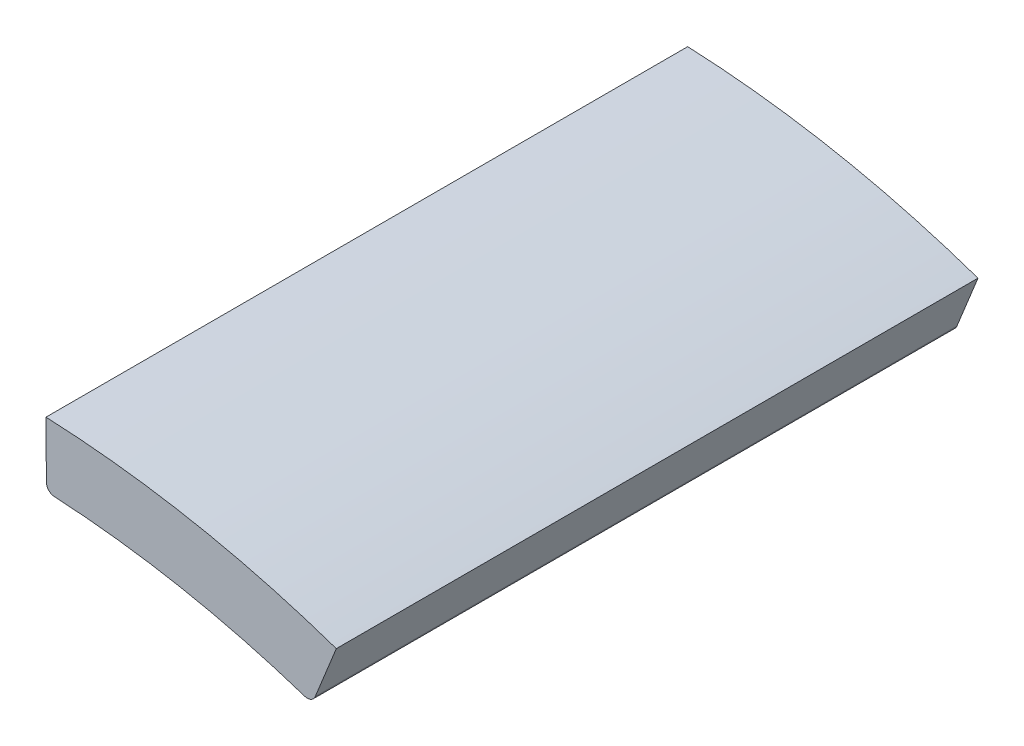
ISO-10303-21;
HEADER;
FILE_DESCRIPTION(('STEP AP214'),'2;1');
FILE_NAME('part.step','',(''),(''),'','','');
FILE_SCHEMA(('AUTOMOTIVE_DESIGN { 1 0 10303 214 1 1 1 1 }'));
ENDSEC;
DATA;
#1=APPLICATION_CONTEXT('core data for automotive mechanical design processes');
#2=APPLICATION_PROTOCOL_DEFINITION('international standard','automotive_design',2000,#1);
#3=PRODUCT_CONTEXT('',#1,'mechanical');
#4=PRODUCT('Part','Part','',(#3));
#5=PRODUCT_RELATED_PRODUCT_CATEGORY('part','',(#4));
#6=PRODUCT_DEFINITION_FORMATION('','',#4);
#7=PRODUCT_DEFINITION_CONTEXT('part definition',#1,'design');
#8=PRODUCT_DEFINITION('design','',#6,#7);
#9=PRODUCT_DEFINITION_SHAPE('','',#8);
#10=(LENGTH_UNIT() NAMED_UNIT(*) SI_UNIT(.MILLI.,.METRE.));
#11=(NAMED_UNIT(*) PLANE_ANGLE_UNIT() SI_UNIT($,.RADIAN.));
#12=(NAMED_UNIT(*) SI_UNIT($,.STERADIAN.) SOLID_ANGLE_UNIT());
#13=UNCERTAINTY_MEASURE_WITH_UNIT(LENGTH_MEASURE(1.E-05),#10,'distance_accuracy_value','');
#14=(GEOMETRIC_REPRESENTATION_CONTEXT(3) GLOBAL_UNCERTAINTY_ASSIGNED_CONTEXT((#13)) GLOBAL_UNIT_ASSIGNED_CONTEXT((#10,
#11,#12)) REPRESENTATION_CONTEXT('',''));
#15=CARTESIAN_POINT('',(0.,0.,0.));
#16=DIRECTION('',(0.,0.,1.));
#17=DIRECTION('',(1.,0.,0.));
#18=AXIS2_PLACEMENT_3D('',#15,#16,#17);
#19=CARTESIAN_POINT('',(-99.4326237515804,21.5657325952445,-15.));
#20=DIRECTION('',(0.,0.,1.));
#21=DIRECTION('',(1.,0.,0.));
#22=AXIS2_PLACEMENT_3D('',#19,#20,#21);
#23=CYLINDRICAL_SURFACE('',#22,0.200000000000001);
#24=CARTESIAN_POINT('',(-99.4326237515804,21.5657325952445,0.));
#25=DIRECTION('',(0.,0.,1.));
#26=DIRECTION('',(1.,0.,0.));
#27=AXIS2_PLACEMENT_3D('',#24,#25,#26);
#28=CIRCLE('',#27,0.200000000000001);
#29=CARTESIAN_POINT('',(-99.4956867111051,21.3759351686655,0.));
#30=VERTEX_POINT('',#29);
#31=CARTESIAN_POINT('',(-99.2472368950267,21.4906878524762,0.));
#32=VERTEX_POINT('',#31);
#33=EDGE_CURVE('E135',#30,#32,#28,.T.);
#34=ORIENTED_EDGE('',*,*,#33,.F.);
#35=DIRECTION('',(0.,0.,1.));
#36=VECTOR('',#35,1.);
#37=CARTESIAN_POINT('',(-99.4956867111051,21.3759351686655,-15.));
#38=LINE('',#37,#36);
#39=CARTESIAN_POINT('',(-99.4956867111051,21.3759351686655,-15.));
#40=VERTEX_POINT('',#39);
#41=EDGE_CURVE('E43',#40,#30,#38,.T.);
#42=ORIENTED_EDGE('',*,*,#41,.F.);
#43=CARTESIAN_POINT('',(-99.4326237515804,21.5657325952445,-15.));
#44=DIRECTION('',(0.,0.,1.));
#45=DIRECTION('',(1.,0.,0.));
#46=AXIS2_PLACEMENT_3D('',#43,#44,#45);
#47=CIRCLE('',#46,0.200000000000001);
#48=CARTESIAN_POINT('',(-99.2472368950267,21.4906878524762,-15.));
#49=VERTEX_POINT('',#48);
#50=EDGE_CURVE('E111',#40,#49,#47,.T.);
#51=ORIENTED_EDGE('',*,*,#50,.T.);
#52=DIRECTION('',(0.,0.,1.));
#53=VECTOR('',#52,1.);
#54=CARTESIAN_POINT('',(-99.2472368950267,21.4906878524762,-15.));
#55=LINE('',#54,#53);
#56=EDGE_CURVE('E11',#49,#32,#55,.T.);
#57=ORIENTED_EDGE('',*,*,#56,.T.);
#58=EDGE_LOOP('',(#34,#42,#51,#57));
#59=FACE_BOUND('',#58,.T.);
#60=ADVANCED_FACE('F33',(#59),#23,.T.);
#61=CARTESIAN_POINT('',(-106.598152526945,3.99624301647085E-12,-15.));
#62=DIRECTION('',(0.,0.,1.));
#63=DIRECTION('',(1.,0.,0.));
#64=AXIS2_PLACEMENT_3D('',#61,#62,#63);
#65=CYLINDRICAL_SURFACE('',#64,22.525);
#66=CARTESIAN_POINT('',(-106.598152526945,3.99624301647085E-12,0.));
#67=DIRECTION('',(0.,0.,-1.));
#68=DIRECTION('',(1.,0.,0.));
#69=AXIS2_PLACEMENT_3D('',#66,#67,#68);
#70=CIRCLE('',#69,22.525);
#71=CARTESIAN_POINT('',(-105.34216191213,22.489955815334,0.));
#72=VERTEX_POINT('',#71);
#73=EDGE_CURVE('E98',#72,#30,#70,.T.);
#74=ORIENTED_EDGE('',*,*,#73,.F.);
#75=DIRECTION('',(0.,0.,1.));
#76=VECTOR('',#75,1.);
#77=CARTESIAN_POINT('',(-105.34216191213,22.489955815334,-15.));
#78=LINE('',#77,#76);
#79=CARTESIAN_POINT('',(-105.34216191213,22.489955815334,-15.));
#80=VERTEX_POINT('',#79);
#81=EDGE_CURVE('E93',#80,#72,#78,.T.);
#82=ORIENTED_EDGE('',*,*,#81,.F.);
#83=CARTESIAN_POINT('',(-106.598152526945,3.99624301647085E-12,-15.));
#84=DIRECTION('',(0.,0.,-1.));
#85=DIRECTION('',(1.,0.,0.));
#86=AXIS2_PLACEMENT_3D('',#83,#84,#85);
#87=CIRCLE('',#86,22.525);
#88=EDGE_CURVE('E96',#80,#40,#87,.T.);
#89=ORIENTED_EDGE('',*,*,#88,.T.);
#90=ORIENTED_EDGE('',*,*,#41,.T.);
#91=EDGE_LOOP('',(#74,#82,#89,#90));
#92=FACE_BOUND('',#91,.T.);
#93=ADVANCED_FACE('F95',(#92),#65,.F.);
#94=CARTESIAN_POINT('',(-105.331009942184,22.6896446572013,-15.));
#95=DIRECTION('',(0.,0.,1.));
#96=DIRECTION('',(1.,0.,0.));
#97=AXIS2_PLACEMENT_3D('',#94,#95,#96);
#98=CYLINDRICAL_SURFACE('',#97,0.200000000000001);
#99=CARTESIAN_POINT('',(-105.331009942184,22.6896446572013,0.));
#100=DIRECTION('',(0.,0.,1.));
#101=DIRECTION('',(1.,0.,0.));
#102=AXIS2_PLACEMENT_3D('',#99,#100,#101);
#103=CIRCLE('',#102,0.200000000000001);
#104=CARTESIAN_POINT('',(-105.531003444294,22.688032480486,0.));
#105=VERTEX_POINT('',#104);
#106=EDGE_CURVE('E132',#105,#72,#103,.T.);
#107=ORIENTED_EDGE('',*,*,#106,.F.);
#108=DIRECTION('',(0.,0.,1.));
#109=VECTOR('',#108,1.);
#110=CARTESIAN_POINT('',(-105.531003444294,22.688032480486,-15.));
#111=LINE('',#110,#109);
#112=CARTESIAN_POINT('',(-105.531003444294,22.688032480486,-15.));
#113=VERTEX_POINT('',#112);
#114=EDGE_CURVE('E103',#113,#105,#111,.T.);
#115=ORIENTED_EDGE('',*,*,#114,.F.);
#116=CARTESIAN_POINT('',(-105.331009942184,22.6896446572013,-15.));
#117=DIRECTION('',(0.,0.,1.));
#118=DIRECTION('',(1.,0.,0.));
#119=AXIS2_PLACEMENT_3D('',#116,#117,#118);
#120=CIRCLE('',#119,0.200000000000001);
#121=EDGE_CURVE('E109',#113,#80,#120,.T.);
#122=ORIENTED_EDGE('',*,*,#121,.T.);
#123=ORIENTED_EDGE('',*,*,#81,.T.);
#124=EDGE_LOOP('',(#107,#115,#122,#123));
#125=FACE_BOUND('',#124,.T.);
#126=ADVANCED_FACE('F114',(#125),#98,.T.);
#127=CARTESIAN_POINT('',(-105.531003444294,22.688032480486,-15.));
#128=DIRECTION('',(-0.99996751055019,-0.00806088357782191,0.));
#129=DIRECTION('',(0.00806088357782192,-0.99996751055019,0.));
#130=AXIS2_PLACEMENT_3D('',#127,#128,#129);
#131=PLANE('',#130);
#132=DIRECTION('',(0.00806088357782192,-0.99996751055019,0.));
#133=VECTOR('',#132,1.);
#134=CARTESIAN_POINT('',(-105.531003444294,22.688032480486,0.));
#135=LINE('',#134,#133);
#136=CARTESIAN_POINT('',(-105.540243689999,23.8343020433346,0.));
#137=VERTEX_POINT('',#136);
#138=EDGE_CURVE('E129',#137,#105,#135,.T.);
#139=ORIENTED_EDGE('',*,*,#138,.F.);
#140=DIRECTION('',(0.,0.,1.));
#141=VECTOR('',#140,1.);
#142=CARTESIAN_POINT('',(-105.540243689999,23.8343020433346,-15.));
#143=LINE('',#142,#141);
#144=CARTESIAN_POINT('',(-105.540243689999,23.8343020433346,-15.));
#145=VERTEX_POINT('',#144);
#146=EDGE_CURVE('E140',#145,#137,#143,.T.);
#147=ORIENTED_EDGE('',*,*,#146,.F.);
#148=DIRECTION('',(0.00806088357782128,-0.99996751055019,0.));
#149=VECTOR('',#148,1.);
#150=CARTESIAN_POINT('',(-105.540243689999,23.8343020433346,-15.));
#151=LINE('',#150,#149);
#152=EDGE_CURVE('E115',#145,#113,#151,.T.);
#153=ORIENTED_EDGE('',*,*,#152,.T.);
#154=ORIENTED_EDGE('',*,*,#114,.T.);
#155=EDGE_LOOP('',(#139,#147,#153,#154));
#156=FACE_BOUND('',#155,.T.);
#157=ADVANCED_FACE('F164',(#156),#131,.T.);
#158=CARTESIAN_POINT('',(-105.540243689999,23.8343020433346,-15.));
#159=DIRECTION('',(-1.,0.,0.));
#160=DIRECTION('',(0.,0.,1.));
#161=AXIS2_PLACEMENT_3D('',#158,#159,#160);
#162=PLANE('',#161);
#163=DIRECTION('',(0.,-1.,0.));
#164=VECTOR('',#163,1.);
#165=CARTESIAN_POINT('',(-105.540243689999,23.8343020433346,0.));
#166=LINE('',#165,#164);
#167=CARTESIAN_POINT('',(-105.540243689999,24.0016968961098,0.));
#168=VERTEX_POINT('',#167);
#169=EDGE_CURVE('E126',#168,#137,#166,.T.);
#170=ORIENTED_EDGE('',*,*,#169,.F.);
#171=DIRECTION('',(0.,0.,1.));
#172=VECTOR('',#171,1.);
#173=CARTESIAN_POINT('',(-105.540243689999,24.0016968961098,-15.));
#174=LINE('',#173,#172);
#175=CARTESIAN_POINT('',(-105.540243689999,24.0016968961098,-15.));
#176=VERTEX_POINT('',#175);
#177=EDGE_CURVE('E142',#176,#168,#174,.T.);
#178=ORIENTED_EDGE('',*,*,#177,.F.);
#179=DIRECTION('',(0.,-1.,0.));
#180=VECTOR('',#179,1.);
#181=CARTESIAN_POINT('',(-105.540243689999,23.8343020433346,-15.));
#182=LINE('',#181,#180);
#183=EDGE_CURVE('E117',#176,#145,#182,.T.);
#184=ORIENTED_EDGE('',*,*,#183,.T.);
#185=ORIENTED_EDGE('',*,*,#146,.T.);
#186=EDGE_LOOP('',(#170,#178,#184,#185));
#187=FACE_BOUND('',#186,.T.);
#188=ADVANCED_FACE('F167',(#187),#162,.T.);
#189=CARTESIAN_POINT('',(-106.598152527033,3.94476118437126E-12,-15.));
#190=DIRECTION('',(0.,0.,1.));
#191=DIRECTION('',(1.,0.,0.));
#192=AXIS2_PLACEMENT_3D('',#189,#190,#191);
#193=CYLINDRICAL_SURFACE('',#192,24.0250000000003);
#194=CARTESIAN_POINT('',(-106.598152527033,3.94476118437126E-12,0.));
#195=DIRECTION('',(0.,0.,1.));
#196=DIRECTION('',(-1.,0.,0.));
#197=AXIS2_PLACEMENT_3D('',#194,#195,#196);
#198=CIRCLE('',#197,24.0250000000003);
#199=CARTESIAN_POINT('',(-98.7542805277487,22.708463115302,0.));
#200=VERTEX_POINT('',#199);
#201=EDGE_CURVE('E123',#200,#168,#198,.T.);
#202=ORIENTED_EDGE('',*,*,#201,.F.);
#203=DIRECTION('',(0.,0.,1.));
#204=VECTOR('',#203,1.);
#205=CARTESIAN_POINT('',(-98.7542805277487,22.708463115302,-15.));
#206=LINE('',#205,#204);
#207=CARTESIAN_POINT('',(-98.7542805277487,22.708463115302,-15.));
#208=VERTEX_POINT('',#207);
#209=EDGE_CURVE('E37',#208,#200,#206,.T.);
#210=ORIENTED_EDGE('',*,*,#209,.F.);
#211=CARTESIAN_POINT('',(-106.598152527033,3.94476118437126E-12,-15.));
#212=DIRECTION('',(0.,0.,1.));
#213=DIRECTION('',(-1.,0.,0.));
#214=AXIS2_PLACEMENT_3D('',#211,#212,#213);
#215=CIRCLE('',#214,24.0250000000003);
#216=EDGE_CURVE('E238',#208,#176,#215,.T.);
#217=ORIENTED_EDGE('',*,*,#216,.T.);
#218=ORIENTED_EDGE('',*,*,#177,.T.);
#219=EDGE_LOOP('',(#202,#210,#217,#218));
#220=FACE_BOUND('',#219,.T.);
#221=ADVANCED_FACE('F148',(#220),#193,.T.);
#222=CARTESIAN_POINT('',(-98.8171153981826,22.5532389292757,-15.));
#223=DIRECTION('',(0.926934282769043,-0.37522371383941,0.));
#224=DIRECTION('',(0.37522371383941,0.926934282769043,0.));
#225=AXIS2_PLACEMENT_3D('',#222,#223,#224);
#226=PLANE('',#225);
#227=DIRECTION('',(0.375223713839409,0.926934282769043,0.));
#228=VECTOR('',#227,1.);
#229=CARTESIAN_POINT('',(-98.8171153981826,22.5532389292757,0.));
#230=LINE('',#229,#228);
#231=EDGE_CURVE('E79',#32,#200,#230,.T.);
#232=ORIENTED_EDGE('',*,*,#231,.F.);
#233=ORIENTED_EDGE('',*,*,#56,.F.);
#234=DIRECTION('',(0.375223713839422,0.926934282769038,0.));
#235=VECTOR('',#234,1.);
#236=CARTESIAN_POINT('',(-99.2472368950267,21.4906878524762,-15.));
#237=LINE('',#236,#235);
#238=EDGE_CURVE('E82',#49,#208,#237,.T.);
#239=ORIENTED_EDGE('',*,*,#238,.T.);
#240=ORIENTED_EDGE('',*,*,#209,.T.);
#241=EDGE_LOOP('',(#232,#233,#239,#240));
#242=FACE_BOUND('',#241,.T.);
#243=ADVANCED_FACE('F35',(#242),#226,.T.);
#244=CARTESIAN_POINT('',(-106.598152527033,3.94476118437126E-12,-15.));
#245=DIRECTION('',(0.,0.,-1.));
#246=DIRECTION('',(-1.,0.,0.));
#247=AXIS2_PLACEMENT_3D('',#244,#245,#246);
#248=PLANE('',#247);
#249=ORIENTED_EDGE('',*,*,#238,.F.);
#250=ORIENTED_EDGE('',*,*,#50,.F.);
#251=ORIENTED_EDGE('',*,*,#88,.F.);
#252=ORIENTED_EDGE('',*,*,#121,.F.);
#253=ORIENTED_EDGE('',*,*,#152,.F.);
#254=ORIENTED_EDGE('',*,*,#183,.F.);
#255=ORIENTED_EDGE('',*,*,#216,.F.);
#256=EDGE_LOOP('',(#249,#250,#251,#252,#253,#254,#255));
#257=FACE_BOUND('',#256,.T.);
#258=ADVANCED_FACE('F107',(#257),#248,.T.);
#259=CARTESIAN_POINT('',(-106.598152527033,3.94476118437126E-12,0.));
#260=DIRECTION('',(0.,0.,-1.));
#261=DIRECTION('',(-1.,0.,0.));
#262=AXIS2_PLACEMENT_3D('',#259,#260,#261);
#263=PLANE('',#262);
#264=ORIENTED_EDGE('',*,*,#33,.T.);
#265=ORIENTED_EDGE('',*,*,#231,.T.);
#266=ORIENTED_EDGE('',*,*,#201,.T.);
#267=ORIENTED_EDGE('',*,*,#169,.T.);
#268=ORIENTED_EDGE('',*,*,#138,.T.);
#269=ORIENTED_EDGE('',*,*,#106,.T.);
#270=ORIENTED_EDGE('',*,*,#73,.T.);
#271=EDGE_LOOP('',(#264,#265,#266,#267,#268,#269,#270));
#272=FACE_BOUND('',#271,.T.);
#273=ADVANCED_FACE('F150',(#272),#263,.F.);
#274=CLOSED_SHELL('',(#60,#93,#126,#157,#188,#221,#243,#258,#273));
#275=MANIFOLD_SOLID_BREP('B2',#274);
#276=ADVANCED_BREP_SHAPE_REPRESENTATION('',(#18,#275),#14);
#277=SHAPE_DEFINITION_REPRESENTATION(#9,#276);
ENDSEC;
END-ISO-10303-21;
